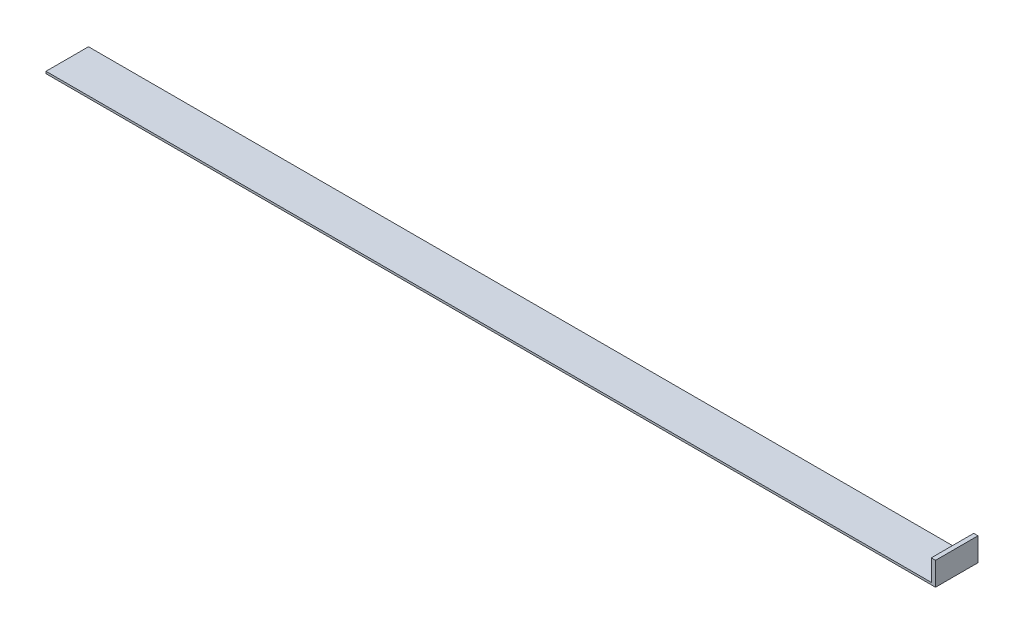
ISO-10303-21;
HEADER;
FILE_DESCRIPTION(('STEP AP214'),'2;1');
FILE_NAME('part.step','',(''),(''),'','','');
FILE_SCHEMA(('AUTOMOTIVE_DESIGN { 1 0 10303 214 1 1 1 1 }'));
ENDSEC;
DATA;
#1=APPLICATION_CONTEXT('core data for automotive mechanical design processes');
#2=APPLICATION_PROTOCOL_DEFINITION('international standard','automotive_design',2000,#1);
#3=PRODUCT_CONTEXT('',#1,'mechanical');
#4=PRODUCT('Part','Part','',(#3));
#5=PRODUCT_RELATED_PRODUCT_CATEGORY('part','',(#4));
#6=PRODUCT_DEFINITION_FORMATION('','',#4);
#7=PRODUCT_DEFINITION_CONTEXT('part definition',#1,'design');
#8=PRODUCT_DEFINITION('design','',#6,#7);
#9=PRODUCT_DEFINITION_SHAPE('','',#8);
#10=(LENGTH_UNIT() NAMED_UNIT(*) SI_UNIT(.MILLI.,.METRE.));
#11=(NAMED_UNIT(*) PLANE_ANGLE_UNIT() SI_UNIT($,.RADIAN.));
#12=(NAMED_UNIT(*) SI_UNIT($,.STERADIAN.) SOLID_ANGLE_UNIT());
#13=UNCERTAINTY_MEASURE_WITH_UNIT(LENGTH_MEASURE(1.E-05),#10,'distance_accuracy_value','');
#14=(GEOMETRIC_REPRESENTATION_CONTEXT(3) GLOBAL_UNCERTAINTY_ASSIGNED_CONTEXT((#13)) GLOBAL_UNIT_ASSIGNED_CONTEXT((#10,
#11,#12)) REPRESENTATION_CONTEXT('',''));
#15=CARTESIAN_POINT('',(0.,0.,0.));
#16=DIRECTION('',(0.,0.,1.));
#17=DIRECTION('',(1.,0.,0.));
#18=AXIS2_PLACEMENT_3D('',#15,#16,#17);
#19=CARTESIAN_POINT('',(0.,0.5,0.));
#20=DIRECTION('',(0.,-1.,0.));
#21=DIRECTION('',(0.,0.,-1.));
#22=AXIS2_PLACEMENT_3D('',#19,#20,#21);
#23=PLANE('',#22);
#24=DIRECTION('',(0.,0.,1.));
#25=VECTOR('',#24,1.);
#26=CARTESIAN_POINT('',(208.39,0.5,-10.));
#27=LINE('',#26,#25);
#28=CARTESIAN_POINT('',(208.39,0.5,-10.));
#29=VERTEX_POINT('',#28);
#30=CARTESIAN_POINT('',(208.39,0.5,0.));
#31=VERTEX_POINT('',#30);
#32=EDGE_CURVE('E59',#29,#31,#27,.T.);
#33=ORIENTED_EDGE('',*,*,#32,.F.);
#34=DIRECTION('',(-1.,0.,0.));
#35=VECTOR('',#34,1.);
#36=CARTESIAN_POINT('',(0.,0.5,-10.));
#37=LINE('',#36,#35);
#38=CARTESIAN_POINT('',(0.,0.5,-10.));
#39=VERTEX_POINT('',#38);
#40=EDGE_CURVE('E64',#29,#39,#37,.T.);
#41=ORIENTED_EDGE('',*,*,#40,.T.);
#42=DIRECTION('',(0.,0.,1.));
#43=VECTOR('',#42,1.);
#44=CARTESIAN_POINT('',(0.,0.5,0.));
#45=LINE('',#44,#43);
#46=CARTESIAN_POINT('',(0.,0.5,0.));
#47=VERTEX_POINT('',#46);
#48=EDGE_CURVE('E96',#39,#47,#45,.T.);
#49=ORIENTED_EDGE('',*,*,#48,.T.);
#50=DIRECTION('',(1.,0.,0.));
#51=VECTOR('',#50,1.);
#52=CARTESIAN_POINT('',(0.,0.5,0.));
#53=LINE('',#52,#51);
#54=EDGE_CURVE('E158',#47,#31,#53,.T.);
#55=ORIENTED_EDGE('',*,*,#54,.T.);
#56=EDGE_LOOP('',(#33,#41,#49,#55));
#57=FACE_BOUND('',#56,.T.);
#58=ADVANCED_FACE('F43',(#57),#23,.F.);
#59=CARTESIAN_POINT('',(0.,0.5,0.));
#60=DIRECTION('',(1.,0.,0.));
#61=DIRECTION('',(0.,0.,-1.));
#62=AXIS2_PLACEMENT_3D('',#59,#60,#61);
#63=PLANE('',#62);
#64=DIRECTION('',(0.,0.,1.));
#65=VECTOR('',#64,1.);
#66=CARTESIAN_POINT('',(0.,0.,0.));
#67=LINE('',#66,#65);
#68=CARTESIAN_POINT('',(0.,0.,-10.));
#69=VERTEX_POINT('',#68);
#70=CARTESIAN_POINT('',(0.,0.,0.));
#71=VERTEX_POINT('',#70);
#72=EDGE_CURVE('E102',#69,#71,#67,.T.);
#73=ORIENTED_EDGE('',*,*,#72,.T.);
#74=DIRECTION('',(0.,-1.,0.));
#75=VECTOR('',#74,1.);
#76=CARTESIAN_POINT('',(0.,0.5,0.));
#77=LINE('',#76,#75);
#78=EDGE_CURVE('E11',#47,#71,#77,.T.);
#79=ORIENTED_EDGE('',*,*,#78,.F.);
#80=ORIENTED_EDGE('',*,*,#48,.F.);
#81=DIRECTION('',(0.,-1.,0.));
#82=VECTOR('',#81,1.);
#83=CARTESIAN_POINT('',(0.,0.5,-10.));
#84=LINE('',#83,#82);
#85=EDGE_CURVE('E87',#39,#69,#84,.T.);
#86=ORIENTED_EDGE('',*,*,#85,.T.);
#87=EDGE_LOOP('',(#73,#79,#80,#86));
#88=FACE_BOUND('',#87,.T.);
#89=ADVANCED_FACE('F45',(#88),#63,.F.);
#90=CARTESIAN_POINT('',(0.,0.5,0.));
#91=DIRECTION('',(0.,0.,-1.));
#92=DIRECTION('',(-1.,0.,0.));
#93=AXIS2_PLACEMENT_3D('',#90,#91,#92);
#94=PLANE('',#93);
#95=DIRECTION('',(1.,0.,0.));
#96=VECTOR('',#95,1.);
#97=CARTESIAN_POINT('',(0.,0.,0.));
#98=LINE('',#97,#96);
#99=CARTESIAN_POINT('',(209.39,0.,0.));
#100=VERTEX_POINT('',#99);
#101=EDGE_CURVE('E106',#71,#100,#98,.T.);
#102=ORIENTED_EDGE('',*,*,#101,.T.);
#103=DIRECTION('',(0.,-1.,0.));
#104=VECTOR('',#103,1.);
#105=CARTESIAN_POINT('',(209.39,0.5,0.));
#106=LINE('',#105,#104);
#107=CARTESIAN_POINT('',(209.39,5.5,0.));
#108=VERTEX_POINT('',#107);
#109=EDGE_CURVE('E52',#108,#100,#106,.T.);
#110=ORIENTED_EDGE('',*,*,#109,.F.);
#111=DIRECTION('',(1.,0.,0.));
#112=VECTOR('',#111,1.);
#113=CARTESIAN_POINT('',(209.39,5.5,0.));
#114=LINE('',#113,#112);
#115=CARTESIAN_POINT('',(208.39,5.5,0.));
#116=VERTEX_POINT('',#115);
#117=EDGE_CURVE('E136',#116,#108,#114,.T.);
#118=ORIENTED_EDGE('',*,*,#117,.F.);
#119=DIRECTION('',(0.,-1.,0.));
#120=VECTOR('',#119,1.);
#121=CARTESIAN_POINT('',(208.39,5.5,0.));
#122=LINE('',#121,#120);
#123=EDGE_CURVE('E114',#116,#31,#122,.T.);
#124=ORIENTED_EDGE('',*,*,#123,.T.);
#125=ORIENTED_EDGE('',*,*,#54,.F.);
#126=ORIENTED_EDGE('',*,*,#78,.T.);
#127=EDGE_LOOP('',(#102,#110,#118,#124,#125,#126));
#128=FACE_BOUND('',#127,.T.);
#129=ADVANCED_FACE('F133',(#128),#94,.F.);
#130=CARTESIAN_POINT('',(209.39,0.5,0.));
#131=DIRECTION('',(-1.,0.,0.));
#132=DIRECTION('',(0.,0.,1.));
#133=AXIS2_PLACEMENT_3D('',#130,#131,#132);
#134=PLANE('',#133);
#135=DIRECTION('',(0.,0.,-1.));
#136=VECTOR('',#135,1.);
#137=CARTESIAN_POINT('',(209.39,0.,0.));
#138=LINE('',#137,#136);
#139=CARTESIAN_POINT('',(209.39,0.,-10.));
#140=VERTEX_POINT('',#139);
#141=EDGE_CURVE('E97',#100,#140,#138,.T.);
#142=ORIENTED_EDGE('',*,*,#141,.T.);
#143=DIRECTION('',(0.,-1.,0.));
#144=VECTOR('',#143,1.);
#145=CARTESIAN_POINT('',(209.39,0.5,-10.));
#146=LINE('',#145,#144);
#147=CARTESIAN_POINT('',(209.39,5.5,-10.));
#148=VERTEX_POINT('',#147);
#149=EDGE_CURVE('E91',#148,#140,#146,.T.);
#150=ORIENTED_EDGE('',*,*,#149,.F.);
#151=DIRECTION('',(0.,0.,-1.));
#152=VECTOR('',#151,1.);
#153=CARTESIAN_POINT('',(209.39,5.5,-10.));
#154=LINE('',#153,#152);
#155=EDGE_CURVE('E129',#108,#148,#154,.T.);
#156=ORIENTED_EDGE('',*,*,#155,.F.);
#157=ORIENTED_EDGE('',*,*,#109,.T.);
#158=EDGE_LOOP('',(#142,#150,#156,#157));
#159=FACE_BOUND('',#158,.T.);
#160=ADVANCED_FACE('F127',(#159),#134,.F.);
#161=CARTESIAN_POINT('',(0.,0.5,-10.));
#162=DIRECTION('',(0.,0.,1.));
#163=DIRECTION('',(1.,0.,0.));
#164=AXIS2_PLACEMENT_3D('',#161,#162,#163);
#165=PLANE('',#164);
#166=DIRECTION('',(-1.,0.,0.));
#167=VECTOR('',#166,1.);
#168=CARTESIAN_POINT('',(0.,0.,-10.));
#169=LINE('',#168,#167);
#170=EDGE_CURVE('E84',#140,#69,#169,.T.);
#171=ORIENTED_EDGE('',*,*,#170,.T.);
#172=ORIENTED_EDGE('',*,*,#85,.F.);
#173=ORIENTED_EDGE('',*,*,#40,.F.);
#174=DIRECTION('',(0.,-1.,0.));
#175=VECTOR('',#174,1.);
#176=CARTESIAN_POINT('',(208.39,5.5,-10.));
#177=LINE('',#176,#175);
#178=CARTESIAN_POINT('',(208.39,5.5,-10.));
#179=VERTEX_POINT('',#178);
#180=EDGE_CURVE('E108',#179,#29,#177,.T.);
#181=ORIENTED_EDGE('',*,*,#180,.F.);
#182=DIRECTION('',(-1.,0.,0.));
#183=VECTOR('',#182,1.);
#184=CARTESIAN_POINT('',(209.39,5.5,-10.));
#185=LINE('',#184,#183);
#186=EDGE_CURVE('E151',#148,#179,#185,.T.);
#187=ORIENTED_EDGE('',*,*,#186,.F.);
#188=ORIENTED_EDGE('',*,*,#149,.T.);
#189=EDGE_LOOP('',(#171,#172,#173,#181,#187,#188));
#190=FACE_BOUND('',#189,.T.);
#191=ADVANCED_FACE('F86',(#190),#165,.F.);
#192=CARTESIAN_POINT('',(0.,0.,0.));
#193=DIRECTION('',(0.,-1.,0.));
#194=DIRECTION('',(0.,0.,-1.));
#195=AXIS2_PLACEMENT_3D('',#192,#193,#194);
#196=PLANE('',#195);
#197=ORIENTED_EDGE('',*,*,#72,.F.);
#198=ORIENTED_EDGE('',*,*,#170,.F.);
#199=ORIENTED_EDGE('',*,*,#141,.F.);
#200=ORIENTED_EDGE('',*,*,#101,.F.);
#201=EDGE_LOOP('',(#197,#198,#199,#200));
#202=FACE_BOUND('',#201,.T.);
#203=ADVANCED_FACE('F105',(#202),#196,.T.);
#204=CARTESIAN_POINT('',(208.39,5.5,-10.));
#205=DIRECTION('',(1.,0.,0.));
#206=DIRECTION('',(0.,0.,-1.));
#207=AXIS2_PLACEMENT_3D('',#204,#205,#206);
#208=PLANE('',#207);
#209=ORIENTED_EDGE('',*,*,#32,.T.);
#210=ORIENTED_EDGE('',*,*,#123,.F.);
#211=DIRECTION('',(0.,0.,1.));
#212=VECTOR('',#211,1.);
#213=CARTESIAN_POINT('',(208.39,5.5,-10.));
#214=LINE('',#213,#212);
#215=EDGE_CURVE('E144',#179,#116,#214,.T.);
#216=ORIENTED_EDGE('',*,*,#215,.F.);
#217=ORIENTED_EDGE('',*,*,#180,.T.);
#218=EDGE_LOOP('',(#209,#210,#216,#217));
#219=FACE_BOUND('',#218,.T.);
#220=ADVANCED_FACE('F163',(#219),#208,.F.);
#221=CARTESIAN_POINT('',(0.,5.5,0.));
#222=DIRECTION('',(0.,-1.,0.));
#223=DIRECTION('',(0.,0.,-1.));
#224=AXIS2_PLACEMENT_3D('',#221,#222,#223);
#225=PLANE('',#224);
#226=ORIENTED_EDGE('',*,*,#155,.T.);
#227=ORIENTED_EDGE('',*,*,#186,.T.);
#228=ORIENTED_EDGE('',*,*,#215,.T.);
#229=ORIENTED_EDGE('',*,*,#117,.T.);
#230=EDGE_LOOP('',(#226,#227,#228,#229));
#231=FACE_BOUND('',#230,.T.);
#232=ADVANCED_FACE('F140',(#231),#225,.F.);
#233=CLOSED_SHELL('',(#58,#89,#129,#160,#191,#203,#220,#232));
#234=MANIFOLD_SOLID_BREP('B2',#233);
#235=ADVANCED_BREP_SHAPE_REPRESENTATION('',(#18,#234),#14);
#236=SHAPE_DEFINITION_REPRESENTATION(#9,#235);
ENDSEC;
END-ISO-10303-21;
